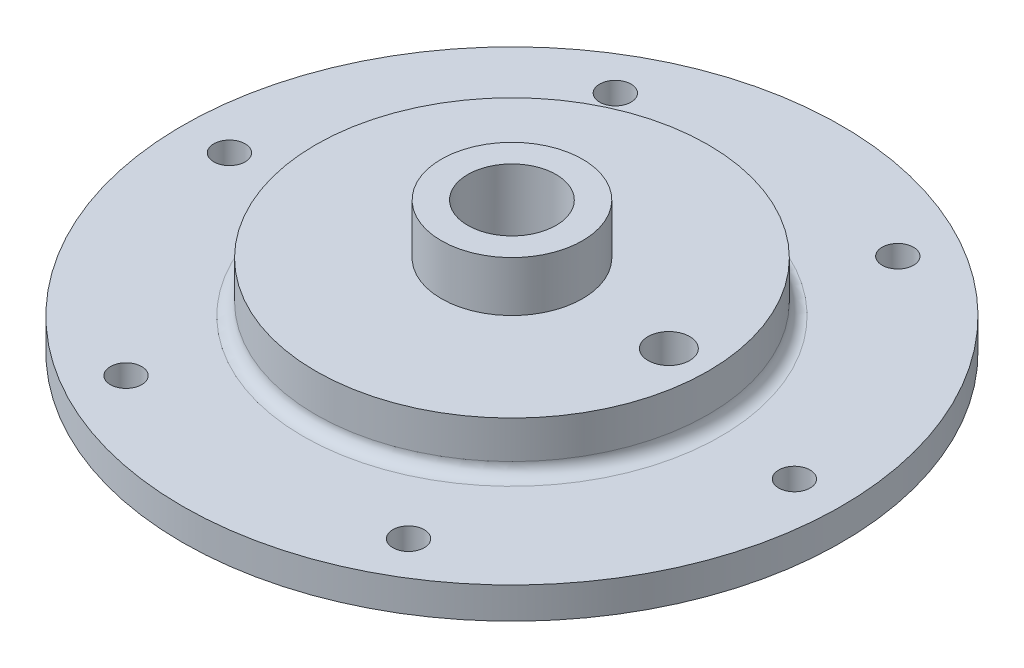
ISO-10303-21;
HEADER;
FILE_DESCRIPTION(('STEP AP214'),'2;1');
FILE_NAME('part.step','',(''),(''),'','','');
FILE_SCHEMA(('AUTOMOTIVE_DESIGN { 1 0 10303 214 1 1 1 1 }'));
ENDSEC;
DATA;
#1=APPLICATION_CONTEXT('core data for automotive mechanical design processes');
#2=APPLICATION_PROTOCOL_DEFINITION('international standard','automotive_design',2000,#1);
#3=PRODUCT_CONTEXT('',#1,'mechanical');
#4=PRODUCT('Part','Part','',(#3));
#5=PRODUCT_RELATED_PRODUCT_CATEGORY('part','',(#4));
#6=PRODUCT_DEFINITION_FORMATION('','',#4);
#7=PRODUCT_DEFINITION_CONTEXT('part definition',#1,'design');
#8=PRODUCT_DEFINITION('design','',#6,#7);
#9=PRODUCT_DEFINITION_SHAPE('','',#8);
#10=(LENGTH_UNIT() NAMED_UNIT(*) SI_UNIT(.MILLI.,.METRE.));
#11=(NAMED_UNIT(*) PLANE_ANGLE_UNIT() SI_UNIT($,.RADIAN.));
#12=(NAMED_UNIT(*) SI_UNIT($,.STERADIAN.) SOLID_ANGLE_UNIT());
#13=UNCERTAINTY_MEASURE_WITH_UNIT(LENGTH_MEASURE(1.E-05),#10,'distance_accuracy_value','');
#14=(GEOMETRIC_REPRESENTATION_CONTEXT(3) GLOBAL_UNCERTAINTY_ASSIGNED_CONTEXT((#13)) GLOBAL_UNIT_ASSIGNED_CONTEXT((#10,
#11,#12)) REPRESENTATION_CONTEXT('',''));
#15=CARTESIAN_POINT('',(0.,0.,0.));
#16=DIRECTION('',(0.,0.,1.));
#17=DIRECTION('',(1.,0.,0.));
#18=AXIS2_PLACEMENT_3D('',#15,#16,#17);
#19=CARTESIAN_POINT('',(0.,6.35,0.));
#20=DIRECTION('',(0.,-1.,0.));
#21=DIRECTION('',(0.,0.,-1.));
#22=AXIS2_PLACEMENT_3D('',#19,#20,#21);
#23=CYLINDRICAL_SURFACE('',#22,66.675);
#24=CARTESIAN_POINT('',(0.,6.35,0.));
#25=DIRECTION('',(0.,1.,0.));
#26=DIRECTION('',(0.,0.,1.));
#27=AXIS2_PLACEMENT_3D('',#24,#25,#26);
#28=CIRCLE('',#27,66.675);
#29=CARTESIAN_POINT('',(0.,6.35,66.675));
#30=VERTEX_POINT('',#29);
#31=EDGE_CURVE('E48',#30,#30,#28,.T.);
#32=ORIENTED_EDGE('',*,*,#31,.F.);
#33=EDGE_LOOP('',(#32));
#34=FACE_BOUND('',#33,.T.);
#35=CARTESIAN_POINT('',(0.,0.,0.));
#36=DIRECTION('',(0.,1.,0.));
#37=DIRECTION('',(0.,0.,1.));
#38=AXIS2_PLACEMENT_3D('',#35,#36,#37);
#39=CIRCLE('',#38,66.675);
#40=CARTESIAN_POINT('',(0.,0.,66.675));
#41=VERTEX_POINT('',#40);
#42=EDGE_CURVE('E52',#41,#41,#39,.T.);
#43=ORIENTED_EDGE('',*,*,#42,.T.);
#44=EDGE_LOOP('',(#43));
#45=FACE_BOUND('',#44,.T.);
#46=ADVANCED_FACE('F37',(#34,#45),#23,.T.);
#47=CARTESIAN_POINT('',(0.,6.35,0.));
#48=DIRECTION('',(0.,1.,0.));
#49=DIRECTION('',(0.,0.,1.));
#50=AXIS2_PLACEMENT_3D('',#47,#48,#49);
#51=PLANE('',#50);
#52=CARTESIAN_POINT('',(-28.5750000000006,6.35,-49.4933518262803));
#53=DIRECTION('',(0.,1.,0.));
#54=DIRECTION('',(0.,0.,1.));
#55=AXIS2_PLACEMENT_3D('',#52,#53,#54);
#56=CIRCLE('',#55,3.175);
#57=CARTESIAN_POINT('',(-28.5750000000006,6.35,-46.3183518262803));
#58=VERTEX_POINT('',#57);
#59=EDGE_CURVE('E99',#58,#58,#56,.T.);
#60=ORIENTED_EDGE('',*,*,#59,.F.);
#61=EDGE_LOOP('',(#60));
#62=FACE_BOUND('',#61,.T.);
#63=CARTESIAN_POINT('',(28.5749999999995,6.35,-49.4933518262809));
#64=DIRECTION('',(0.,1.,0.));
#65=DIRECTION('',(0.,0.,1.));
#66=AXIS2_PLACEMENT_3D('',#63,#64,#65);
#67=CIRCLE('',#66,3.175);
#68=CARTESIAN_POINT('',(28.5749999999995,6.35,-46.3183518262809));
#69=VERTEX_POINT('',#68);
#70=EDGE_CURVE('E93',#69,#69,#67,.T.);
#71=ORIENTED_EDGE('',*,*,#70,.F.);
#72=EDGE_LOOP('',(#71));
#73=FACE_BOUND('',#72,.T.);
#74=CARTESIAN_POINT('',(57.15,6.35,0.));
#75=DIRECTION('',(0.,1.,0.));
#76=DIRECTION('',(0.,0.,1.));
#77=AXIS2_PLACEMENT_3D('',#74,#75,#76);
#78=CIRCLE('',#77,3.175);
#79=CARTESIAN_POINT('',(57.15,6.35,3.175));
#80=VERTEX_POINT('',#79);
#81=EDGE_CURVE('E87',#80,#80,#78,.T.);
#82=ORIENTED_EDGE('',*,*,#81,.F.);
#83=EDGE_LOOP('',(#82));
#84=FACE_BOUND('',#83,.T.);
#85=CARTESIAN_POINT('',(28.5750000000002,6.35,49.4933518262805));
#86=DIRECTION('',(0.,1.,0.));
#87=DIRECTION('',(0.,0.,1.));
#88=AXIS2_PLACEMENT_3D('',#85,#86,#87);
#89=CIRCLE('',#88,3.175);
#90=CARTESIAN_POINT('',(28.5750000000002,6.35,52.6683518262805));
#91=VERTEX_POINT('',#90);
#92=EDGE_CURVE('E81',#91,#91,#89,.T.);
#93=ORIENTED_EDGE('',*,*,#92,.F.);
#94=EDGE_LOOP('',(#93));
#95=FACE_BOUND('',#94,.T.);
#96=CARTESIAN_POINT('',(-28.5749999999999,6.35,49.4933518262807));
#97=DIRECTION('',(0.,1.,0.));
#98=DIRECTION('',(0.,0.,1.));
#99=AXIS2_PLACEMENT_3D('',#96,#97,#98);
#100=CIRCLE('',#99,3.175);
#101=CARTESIAN_POINT('',(-28.5749999999999,6.35,52.6683518262807));
#102=VERTEX_POINT('',#101);
#103=EDGE_CURVE('E75',#102,#102,#100,.T.);
#104=ORIENTED_EDGE('',*,*,#103,.F.);
#105=EDGE_LOOP('',(#104));
#106=FACE_BOUND('',#105,.T.);
#107=CARTESIAN_POINT('',(-57.15,6.35,0.));
#108=DIRECTION('',(0.,1.,0.));
#109=DIRECTION('',(0.,0.,1.));
#110=AXIS2_PLACEMENT_3D('',#107,#108,#109);
#111=CIRCLE('',#110,3.175);
#112=CARTESIAN_POINT('',(-57.15,6.35,3.175));
#113=VERTEX_POINT('',#112);
#114=EDGE_CURVE('E69',#113,#113,#111,.T.);
#115=ORIENTED_EDGE('',*,*,#114,.F.);
#116=EDGE_LOOP('',(#115));
#117=FACE_BOUND('',#116,.T.);
#118=CARTESIAN_POINT('',(0.,6.35,0.));
#119=DIRECTION('',(0.,1.,0.));
#120=DIRECTION('',(0.,0.,1.));
#121=AXIS2_PLACEMENT_3D('',#118,#119,#120);
#122=CIRCLE('',#121,42.2275);
#123=CARTESIAN_POINT('',(0.,6.35,42.2275));
#124=VERTEX_POINT('',#123);
#125=EDGE_CURVE('E10',#124,#124,#122,.F.);
#126=ORIENTED_EDGE('',*,*,#125,.T.);
#127=EDGE_LOOP('',(#126));
#128=FACE_BOUND('',#127,.T.);
#129=ORIENTED_EDGE('',*,*,#31,.T.);
#130=EDGE_LOOP('',(#129));
#131=FACE_BOUND('',#130,.T.);
#132=ADVANCED_FACE('F170',(#62,#73,#84,#95,#106,#117,#128,#131),#51,.T.);
#133=CARTESIAN_POINT('',(0.,0.,0.));
#134=DIRECTION('',(0.,1.,0.));
#135=DIRECTION('',(0.,0.,1.));
#136=AXIS2_PLACEMENT_3D('',#133,#134,#135);
#137=PLANE('',#136);
#138=CARTESIAN_POINT('',(0.,0.,0.));
#139=DIRECTION('',(0.,-1.,0.));
#140=DIRECTION('',(0.,0.,-1.));
#141=AXIS2_PLACEMENT_3D('',#138,#139,#140);
#142=CIRCLE('',#141,42.9514);
#143=CARTESIAN_POINT('',(0.,0.,-42.9514));
#144=VERTEX_POINT('',#143);
#145=EDGE_CURVE('E108',#144,#144,#142,.T.);
#146=ORIENTED_EDGE('',*,*,#145,.F.);
#147=EDGE_LOOP('',(#146));
#148=FACE_BOUND('',#147,.T.);
#149=CARTESIAN_POINT('',(-28.5750000000006,0.,-49.4933518262803));
#150=DIRECTION('',(0.,1.,0.));
#151=DIRECTION('',(0.,0.,1.));
#152=AXIS2_PLACEMENT_3D('',#149,#150,#151);
#153=CIRCLE('',#152,3.175);
#154=CARTESIAN_POINT('',(-28.5750000000006,0.,-46.3183518262803));
#155=VERTEX_POINT('',#154);
#156=EDGE_CURVE('E96',#155,#155,#153,.T.);
#157=ORIENTED_EDGE('',*,*,#156,.T.);
#158=EDGE_LOOP('',(#157));
#159=FACE_BOUND('',#158,.T.);
#160=CARTESIAN_POINT('',(28.5749999999995,0.,-49.4933518262809));
#161=DIRECTION('',(0.,1.,0.));
#162=DIRECTION('',(0.,0.,1.));
#163=AXIS2_PLACEMENT_3D('',#160,#161,#162);
#164=CIRCLE('',#163,3.175);
#165=CARTESIAN_POINT('',(28.5749999999995,0.,-46.3183518262809));
#166=VERTEX_POINT('',#165);
#167=EDGE_CURVE('E90',#166,#166,#164,.T.);
#168=ORIENTED_EDGE('',*,*,#167,.T.);
#169=EDGE_LOOP('',(#168));
#170=FACE_BOUND('',#169,.T.);
#171=CARTESIAN_POINT('',(57.15,0.,0.));
#172=DIRECTION('',(0.,1.,0.));
#173=DIRECTION('',(0.,0.,1.));
#174=AXIS2_PLACEMENT_3D('',#171,#172,#173);
#175=CIRCLE('',#174,3.175);
#176=CARTESIAN_POINT('',(57.15,0.,3.175));
#177=VERTEX_POINT('',#176);
#178=EDGE_CURVE('E84',#177,#177,#175,.T.);
#179=ORIENTED_EDGE('',*,*,#178,.T.);
#180=EDGE_LOOP('',(#179));
#181=FACE_BOUND('',#180,.T.);
#182=CARTESIAN_POINT('',(28.5750000000002,0.,49.4933518262805));
#183=DIRECTION('',(0.,1.,0.));
#184=DIRECTION('',(0.,0.,1.));
#185=AXIS2_PLACEMENT_3D('',#182,#183,#184);
#186=CIRCLE('',#185,3.175);
#187=CARTESIAN_POINT('',(28.5750000000002,0.,52.6683518262805));
#188=VERTEX_POINT('',#187);
#189=EDGE_CURVE('E78',#188,#188,#186,.T.);
#190=ORIENTED_EDGE('',*,*,#189,.T.);
#191=EDGE_LOOP('',(#190));
#192=FACE_BOUND('',#191,.T.);
#193=CARTESIAN_POINT('',(-28.5749999999999,0.,49.4933518262807));
#194=DIRECTION('',(0.,1.,0.));
#195=DIRECTION('',(0.,0.,1.));
#196=AXIS2_PLACEMENT_3D('',#193,#194,#195);
#197=CIRCLE('',#196,3.175);
#198=CARTESIAN_POINT('',(-28.5749999999999,0.,52.6683518262807));
#199=VERTEX_POINT('',#198);
#200=EDGE_CURVE('E72',#199,#199,#197,.T.);
#201=ORIENTED_EDGE('',*,*,#200,.T.);
#202=EDGE_LOOP('',(#201));
#203=FACE_BOUND('',#202,.T.);
#204=CARTESIAN_POINT('',(-57.15,0.,0.));
#205=DIRECTION('',(0.,1.,0.));
#206=DIRECTION('',(0.,0.,1.));
#207=AXIS2_PLACEMENT_3D('',#204,#205,#206);
#208=CIRCLE('',#207,3.175);
#209=CARTESIAN_POINT('',(-57.15,0.,3.175));
#210=VERTEX_POINT('',#209);
#211=EDGE_CURVE('E64',#210,#210,#208,.T.);
#212=ORIENTED_EDGE('',*,*,#211,.T.);
#213=EDGE_LOOP('',(#212));
#214=FACE_BOUND('',#213,.T.);
#215=ORIENTED_EDGE('',*,*,#42,.F.);
#216=EDGE_LOOP('',(#215));
#217=FACE_BOUND('',#216,.T.);
#218=ADVANCED_FACE('F165',(#148,#159,#170,#181,#192,#203,#214,#217),#137,.F.);
#219=CARTESIAN_POINT('',(0.,16.51,0.));
#220=DIRECTION('',(0.,-1.,0.));
#221=DIRECTION('',(0.,0.,-1.));
#222=AXIS2_PLACEMENT_3D('',#219,#220,#221);
#223=CYLINDRICAL_SURFACE('',#222,39.6875);
#224=CARTESIAN_POINT('',(0.,8.89,0.));
#225=DIRECTION('',(0.,1.,0.));
#226=DIRECTION('',(0.,0.,1.));
#227=AXIS2_PLACEMENT_3D('',#224,#225,#226);
#228=CIRCLE('',#227,39.6875);
#229=CARTESIAN_POINT('',(0.,8.89,39.6875));
#230=VERTEX_POINT('',#229);
#231=EDGE_CURVE('E44',#230,#230,#228,.T.);
#232=ORIENTED_EDGE('',*,*,#231,.T.);
#233=EDGE_LOOP('',(#232));
#234=FACE_BOUND('',#233,.T.);
#235=CARTESIAN_POINT('',(0.,16.51,0.));
#236=DIRECTION('',(0.,1.,0.));
#237=DIRECTION('',(0.,0.,1.));
#238=AXIS2_PLACEMENT_3D('',#235,#236,#237);
#239=CIRCLE('',#238,39.6875);
#240=CARTESIAN_POINT('',(0.,16.51,39.6875));
#241=VERTEX_POINT('',#240);
#242=EDGE_CURVE('E56',#241,#241,#239,.T.);
#243=ORIENTED_EDGE('',*,*,#242,.F.);
#244=EDGE_LOOP('',(#243));
#245=FACE_BOUND('',#244,.T.);
#246=ADVANCED_FACE('F158',(#234,#245),#223,.T.);
#247=CARTESIAN_POINT('',(0.,16.51,0.));
#248=DIRECTION('',(0.,1.,0.));
#249=DIRECTION('',(0.,0.,1.));
#250=AXIS2_PLACEMENT_3D('',#247,#248,#249);
#251=PLANE('',#250);
#252=CARTESIAN_POINT('',(0.,16.51,0.));
#253=DIRECTION('',(0.,1.,0.));
#254=DIRECTION('',(0.,0.,1.));
#255=AXIS2_PLACEMENT_3D('',#252,#253,#254);
#256=CIRCLE('',#255,14.2875);
#257=CARTESIAN_POINT('',(0.,16.51,14.2875));
#258=VERTEX_POINT('',#257);
#259=EDGE_CURVE('E127',#258,#258,#256,.T.);
#260=ORIENTED_EDGE('',*,*,#259,.F.);
#261=EDGE_LOOP('',(#260));
#262=FACE_BOUND('',#261,.T.);
#263=CARTESIAN_POINT('',(31.75,16.51,0.));
#264=DIRECTION('',(0.,1.,0.));
#265=DIRECTION('',(0.,0.,1.));
#266=AXIS2_PLACEMENT_3D('',#263,#264,#265);
#267=CIRCLE('',#266,4.21639999999999);
#268=CARTESIAN_POINT('',(31.75,16.51,4.21639999999999));
#269=VERTEX_POINT('',#268);
#270=EDGE_CURVE('E117',#269,#269,#267,.T.);
#271=ORIENTED_EDGE('',*,*,#270,.F.);
#272=EDGE_LOOP('',(#271));
#273=FACE_BOUND('',#272,.T.);
#274=ORIENTED_EDGE('',*,*,#242,.T.);
#275=EDGE_LOOP('',(#274));
#276=FACE_BOUND('',#275,.T.);
#277=ADVANCED_FACE('F155',(#262,#273,#276),#251,.T.);
#278=CARTESIAN_POINT('',(0.,8.89,0.));
#279=DIRECTION('',(0.,1.,0.));
#280=DIRECTION('',(0.,0.,1.));
#281=AXIS2_PLACEMENT_3D('',#278,#279,#280);
#282=TOROIDAL_SURFACE('',#281,42.2275,2.54);
#283=ORIENTED_EDGE('',*,*,#125,.F.);
#284=EDGE_LOOP('',(#283));
#285=FACE_BOUND('',#284,.T.);
#286=ORIENTED_EDGE('',*,*,#231,.F.);
#287=EDGE_LOOP('',(#286));
#288=FACE_BOUND('',#287,.T.);
#289=ADVANCED_FACE('F39',(#285,#288),#282,.F.);
#290=CARTESIAN_POINT('',(-57.15,6.35,0.));
#291=DIRECTION('',(0.,1.,0.));
#292=DIRECTION('',(0.,0.,1.));
#293=AXIS2_PLACEMENT_3D('',#290,#291,#292);
#294=CYLINDRICAL_SURFACE('',#293,3.175);
#295=ORIENTED_EDGE('',*,*,#211,.F.);
#296=EDGE_LOOP('',(#295));
#297=FACE_BOUND('',#296,.T.);
#298=ORIENTED_EDGE('',*,*,#114,.T.);
#299=EDGE_LOOP('',(#298));
#300=FACE_BOUND('',#299,.T.);
#301=ADVANCED_FACE('F200',(#297,#300),#294,.F.);
#302=CARTESIAN_POINT('',(-28.5749999999999,6.35,49.4933518262807));
#303=DIRECTION('',(0.,1.,0.));
#304=DIRECTION('',(0.,0.,1.));
#305=AXIS2_PLACEMENT_3D('',#302,#303,#304);
#306=CYLINDRICAL_SURFACE('',#305,3.175);
#307=ORIENTED_EDGE('',*,*,#200,.F.);
#308=EDGE_LOOP('',(#307));
#309=FACE_BOUND('',#308,.T.);
#310=ORIENTED_EDGE('',*,*,#103,.T.);
#311=EDGE_LOOP('',(#310));
#312=FACE_BOUND('',#311,.T.);
#313=ADVANCED_FACE('F202',(#309,#312),#306,.F.);
#314=CARTESIAN_POINT('',(28.5750000000002,6.35,49.4933518262805));
#315=DIRECTION('',(0.,1.,0.));
#316=DIRECTION('',(0.,0.,1.));
#317=AXIS2_PLACEMENT_3D('',#314,#315,#316);
#318=CYLINDRICAL_SURFACE('',#317,3.175);
#319=ORIENTED_EDGE('',*,*,#189,.F.);
#320=EDGE_LOOP('',(#319));
#321=FACE_BOUND('',#320,.T.);
#322=ORIENTED_EDGE('',*,*,#92,.T.);
#323=EDGE_LOOP('',(#322));
#324=FACE_BOUND('',#323,.T.);
#325=ADVANCED_FACE('F209',(#321,#324),#318,.F.);
#326=CARTESIAN_POINT('',(57.15,6.35,0.));
#327=DIRECTION('',(0.,1.,0.));
#328=DIRECTION('',(0.,0.,1.));
#329=AXIS2_PLACEMENT_3D('',#326,#327,#328);
#330=CYLINDRICAL_SURFACE('',#329,3.175);
#331=ORIENTED_EDGE('',*,*,#178,.F.);
#332=EDGE_LOOP('',(#331));
#333=FACE_BOUND('',#332,.T.);
#334=ORIENTED_EDGE('',*,*,#81,.T.);
#335=EDGE_LOOP('',(#334));
#336=FACE_BOUND('',#335,.T.);
#337=ADVANCED_FACE('F276',(#333,#336),#330,.F.);
#338=CARTESIAN_POINT('',(28.5749999999995,6.35,-49.4933518262809));
#339=DIRECTION('',(0.,1.,0.));
#340=DIRECTION('',(0.,0.,1.));
#341=AXIS2_PLACEMENT_3D('',#338,#339,#340);
#342=CYLINDRICAL_SURFACE('',#341,3.175);
#343=ORIENTED_EDGE('',*,*,#167,.F.);
#344=EDGE_LOOP('',(#343));
#345=FACE_BOUND('',#344,.T.);
#346=ORIENTED_EDGE('',*,*,#70,.T.);
#347=EDGE_LOOP('',(#346));
#348=FACE_BOUND('',#347,.T.);
#349=ADVANCED_FACE('F280',(#345,#348),#342,.F.);
#350=CARTESIAN_POINT('',(-28.5750000000006,6.35,-49.4933518262803));
#351=DIRECTION('',(0.,1.,0.));
#352=DIRECTION('',(0.,0.,1.));
#353=AXIS2_PLACEMENT_3D('',#350,#351,#352);
#354=CYLINDRICAL_SURFACE('',#353,3.175);
#355=ORIENTED_EDGE('',*,*,#156,.F.);
#356=EDGE_LOOP('',(#355));
#357=FACE_BOUND('',#356,.T.);
#358=ORIENTED_EDGE('',*,*,#59,.T.);
#359=EDGE_LOOP('',(#358));
#360=FACE_BOUND('',#359,.T.);
#361=ADVANCED_FACE('F248',(#357,#360),#354,.F.);
#362=CARTESIAN_POINT('',(0.,-1.27,0.));
#363=DIRECTION('',(0.,-1.,0.));
#364=DIRECTION('',(0.,0.,-1.));
#365=AXIS2_PLACEMENT_3D('',#362,#363,#364);
#366=CYLINDRICAL_SURFACE('',#365,37.6174);
#367=CARTESIAN_POINT('',(0.,0.,0.));
#368=DIRECTION('',(0.,-1.,0.));
#369=DIRECTION('',(0.,0.,-1.));
#370=AXIS2_PLACEMENT_3D('',#367,#368,#369);
#371=CIRCLE('',#370,37.6174);
#372=CARTESIAN_POINT('',(0.,0.,-37.6174));
#373=VERTEX_POINT('',#372);
#374=EDGE_CURVE('E111',#373,#373,#371,.T.);
#375=ORIENTED_EDGE('',*,*,#374,.F.);
#376=EDGE_LOOP('',(#375));
#377=FACE_BOUND('',#376,.T.);
#378=CARTESIAN_POINT('',(0.,2.7178,0.));
#379=DIRECTION('',(0.,-1.,0.));
#380=DIRECTION('',(0.,0.,-1.));
#381=AXIS2_PLACEMENT_3D('',#378,#379,#380);
#382=CIRCLE('',#381,37.6174);
#383=CARTESIAN_POINT('',(0.,2.7178,-37.6174));
#384=VERTEX_POINT('',#383);
#385=EDGE_CURVE('E102',#384,#384,#382,.T.);
#386=ORIENTED_EDGE('',*,*,#385,.T.);
#387=EDGE_LOOP('',(#386));
#388=FACE_BOUND('',#387,.T.);
#389=ADVANCED_FACE('F244',(#377,#388),#366,.T.);
#390=CARTESIAN_POINT('',(37.6174,2.7178,0.));
#391=DIRECTION('',(0.,1.,0.));
#392=DIRECTION('',(0.,0.,1.));
#393=AXIS2_PLACEMENT_3D('',#390,#391,#392);
#394=PLANE('',#393);
#395=ORIENTED_EDGE('',*,*,#385,.F.);
#396=EDGE_LOOP('',(#395));
#397=FACE_BOUND('',#396,.T.);
#398=CARTESIAN_POINT('',(0.,2.7178,0.));
#399=DIRECTION('',(0.,-1.,0.));
#400=DIRECTION('',(0.,0.,-1.));
#401=AXIS2_PLACEMENT_3D('',#398,#399,#400);
#402=CIRCLE('',#401,42.9514);
#403=CARTESIAN_POINT('',(0.,2.7178,-42.9514));
#404=VERTEX_POINT('',#403);
#405=EDGE_CURVE('E105',#404,#404,#402,.T.);
#406=ORIENTED_EDGE('',*,*,#405,.T.);
#407=EDGE_LOOP('',(#406));
#408=FACE_BOUND('',#407,.T.);
#409=ADVANCED_FACE('F247',(#397,#408),#394,.F.);
#410=CARTESIAN_POINT('',(0.,-1.27,0.));
#411=DIRECTION('',(0.,-1.,0.));
#412=DIRECTION('',(0.,0.,-1.));
#413=AXIS2_PLACEMENT_3D('',#410,#411,#412);
#414=CYLINDRICAL_SURFACE('',#413,42.9514);
#415=ORIENTED_EDGE('',*,*,#405,.F.);
#416=EDGE_LOOP('',(#415));
#417=FACE_BOUND('',#416,.T.);
#418=ORIENTED_EDGE('',*,*,#145,.T.);
#419=EDGE_LOOP('',(#418));
#420=FACE_BOUND('',#419,.T.);
#421=ADVANCED_FACE('F220',(#417,#420),#414,.F.);
#422=CARTESIAN_POINT('',(0.,11.557,0.));
#423=DIRECTION('',(0.,-1.,0.));
#424=DIRECTION('',(0.,0.,-1.));
#425=AXIS2_PLACEMENT_3D('',#422,#423,#424);
#426=PLANE('',#425);
#427=CARTESIAN_POINT('',(0.,11.557,0.));
#428=DIRECTION('',(0.,-1.,0.));
#429=DIRECTION('',(0.,0.,-1.));
#430=AXIS2_PLACEMENT_3D('',#427,#428,#429);
#431=CIRCLE('',#430,8.929751);
#432=CARTESIAN_POINT('',(0.,11.557,-8.929751));
#433=VERTEX_POINT('',#432);
#434=EDGE_CURVE('E130',#433,#433,#431,.T.);
#435=ORIENTED_EDGE('',*,*,#434,.F.);
#436=EDGE_LOOP('',(#435));
#437=FACE_BOUND('',#436,.T.);
#438=CARTESIAN_POINT('',(0.,11.557,0.));
#439=DIRECTION('',(0.,-1.,0.));
#440=DIRECTION('',(0.,0.,-1.));
#441=AXIS2_PLACEMENT_3D('',#438,#439,#440);
#442=CIRCLE('',#441,23.749);
#443=CARTESIAN_POINT('',(0.,11.557,-23.749));
#444=VERTEX_POINT('',#443);
#445=EDGE_CURVE('E60',#444,#444,#442,.T.);
#446=ORIENTED_EDGE('',*,*,#445,.T.);
#447=EDGE_LOOP('',(#446));
#448=FACE_BOUND('',#447,.T.);
#449=ADVANCED_FACE('F216',(#437,#448),#426,.T.);
#450=CARTESIAN_POINT('',(0.,11.557,0.));
#451=DIRECTION('',(0.,-1.,0.));
#452=DIRECTION('',(0.,0.,-1.));
#453=AXIS2_PLACEMENT_3D('',#450,#451,#452);
#454=CYLINDRICAL_SURFACE('',#453,23.749);
#455=ORIENTED_EDGE('',*,*,#445,.F.);
#456=EDGE_LOOP('',(#455));
#457=FACE_BOUND('',#456,.T.);
#458=CARTESIAN_POINT('',(0.,0.,0.));
#459=DIRECTION('',(0.,-1.,0.));
#460=DIRECTION('',(0.,0.,-1.));
#461=AXIS2_PLACEMENT_3D('',#458,#459,#460);
#462=CIRCLE('',#461,23.749);
#463=CARTESIAN_POINT('',(0.,0.,-23.749));
#464=VERTEX_POINT('',#463);
#465=EDGE_CURVE('E61',#464,#464,#462,.T.);
#466=ORIENTED_EDGE('',*,*,#465,.T.);
#467=EDGE_LOOP('',(#466));
#468=FACE_BOUND('',#467,.T.);
#469=ADVANCED_FACE('F219',(#457,#468),#454,.F.);
#470=CARTESIAN_POINT('',(31.75,0.,0.));
#471=DIRECTION('',(0.,-1.,0.));
#472=DIRECTION('',(0.,0.,-1.));
#473=AXIS2_PLACEMENT_3D('',#470,#471,#472);
#474=CIRCLE('',#473,1.19062499999999);
#475=CARTESIAN_POINT('',(31.75,0.,-1.19062499999999));
#476=VERTEX_POINT('',#475);
#477=EDGE_CURVE('E123',#476,#476,#474,.T.);
#478=ORIENTED_EDGE('',*,*,#477,.F.);
#479=EDGE_LOOP('',(#478));
#480=FACE_BOUND('',#479,.T.);
#481=ORIENTED_EDGE('',*,*,#374,.T.);
#482=EDGE_LOOP('',(#481));
#483=FACE_BOUND('',#482,.T.);
#484=ORIENTED_EDGE('',*,*,#465,.F.);
#485=EDGE_LOOP('',(#484));
#486=FACE_BOUND('',#485,.T.);
#487=ADVANCED_FACE('F173',(#480,#483,#486),#137,.F.);
#488=CARTESIAN_POINT('',(31.75,7.62,0.));
#489=DIRECTION('',(0.,1.,0.));
#490=DIRECTION('',(0.,0.,1.));
#491=AXIS2_PLACEMENT_3D('',#488,#489,#490);
#492=CONICAL_SURFACE('',#491,4.21639999999999,1.02974425867665);
#493=CARTESIAN_POINT('',(31.75,5.80193096046188,0.));
#494=DIRECTION('',(0.,1.,0.));
#495=DIRECTION('',(0.,0.,1.));
#496=AXIS2_PLACEMENT_3D('',#493,#494,#495);
#497=CIRCLE('',#496,1.19062499999999);
#498=CARTESIAN_POINT('',(31.75,5.80193096046188,1.19062499999999));
#499=VERTEX_POINT('',#498);
#500=EDGE_CURVE('E120',#499,#499,#497,.F.);
#501=ORIENTED_EDGE('',*,*,#500,.T.);
#502=EDGE_LOOP('',(#501));
#503=FACE_BOUND('',#502,.T.);
#504=CARTESIAN_POINT('',(31.75,7.62,0.));
#505=DIRECTION('',(0.,1.,0.));
#506=DIRECTION('',(0.,0.,1.));
#507=AXIS2_PLACEMENT_3D('',#504,#505,#506);
#508=CIRCLE('',#507,4.21639999999999);
#509=CARTESIAN_POINT('',(31.75,7.62,4.21639999999999));
#510=VERTEX_POINT('',#509);
#511=EDGE_CURVE('E114',#510,#510,#508,.T.);
#512=ORIENTED_EDGE('',*,*,#511,.T.);
#513=EDGE_LOOP('',(#512));
#514=FACE_BOUND('',#513,.T.);
#515=ADVANCED_FACE('F227',(#503,#514),#492,.F.);
#516=CARTESIAN_POINT('',(31.75,16.51,0.));
#517=DIRECTION('',(0.,1.,0.));
#518=DIRECTION('',(0.,0.,1.));
#519=AXIS2_PLACEMENT_3D('',#516,#517,#518);
#520=CYLINDRICAL_SURFACE('',#519,4.21639999999999);
#521=ORIENTED_EDGE('',*,*,#511,.F.);
#522=EDGE_LOOP('',(#521));
#523=FACE_BOUND('',#522,.T.);
#524=ORIENTED_EDGE('',*,*,#270,.T.);
#525=EDGE_LOOP('',(#524));
#526=FACE_BOUND('',#525,.T.);
#527=ADVANCED_FACE('F237',(#523,#526),#520,.F.);
#528=CARTESIAN_POINT('',(31.75,0.,0.));
#529=DIRECTION('',(0.,-1.,0.));
#530=DIRECTION('',(0.,0.,-1.));
#531=AXIS2_PLACEMENT_3D('',#528,#529,#530);
#532=CYLINDRICAL_SURFACE('',#531,1.19062499999999);
#533=ORIENTED_EDGE('',*,*,#477,.T.);
#534=EDGE_LOOP('',(#533));
#535=FACE_BOUND('',#534,.T.);
#536=ORIENTED_EDGE('',*,*,#500,.F.);
#537=EDGE_LOOP('',(#536));
#538=FACE_BOUND('',#537,.T.);
#539=ADVANCED_FACE('F151',(#535,#538),#532,.F.);
#540=CARTESIAN_POINT('',(0.,26.67,0.));
#541=DIRECTION('',(0.,-1.,0.));
#542=DIRECTION('',(0.,0.,-1.));
#543=AXIS2_PLACEMENT_3D('',#540,#541,#542);
#544=CYLINDRICAL_SURFACE('',#543,14.2875);
#545=CARTESIAN_POINT('',(0.,26.67,0.));
#546=DIRECTION('',(0.,1.,0.));
#547=DIRECTION('',(0.,0.,1.));
#548=AXIS2_PLACEMENT_3D('',#545,#546,#547);
#549=CIRCLE('',#548,14.2875);
#550=CARTESIAN_POINT('',(0.,26.67,14.2875));
#551=VERTEX_POINT('',#550);
#552=EDGE_CURVE('E126',#551,#551,#549,.T.);
#553=ORIENTED_EDGE('',*,*,#552,.F.);
#554=EDGE_LOOP('',(#553));
#555=FACE_BOUND('',#554,.T.);
#556=ORIENTED_EDGE('',*,*,#259,.T.);
#557=EDGE_LOOP('',(#556));
#558=FACE_BOUND('',#557,.T.);
#559=ADVANCED_FACE('F145',(#555,#558),#544,.T.);
#560=CARTESIAN_POINT('',(0.,26.67,0.));
#561=DIRECTION('',(0.,1.,0.));
#562=DIRECTION('',(0.,0.,1.));
#563=AXIS2_PLACEMENT_3D('',#560,#561,#562);
#564=PLANE('',#563);
#565=CARTESIAN_POINT('',(0.,26.67,0.));
#566=DIRECTION('',(0.,1.,0.));
#567=DIRECTION('',(0.,0.,1.));
#568=AXIS2_PLACEMENT_3D('',#565,#566,#567);
#569=CIRCLE('',#568,8.929751);
#570=CARTESIAN_POINT('',(0.,26.67,8.929751));
#571=VERTEX_POINT('',#570);
#572=EDGE_CURVE('E135',#571,#571,#569,.T.);
#573=ORIENTED_EDGE('',*,*,#572,.F.);
#574=EDGE_LOOP('',(#573));
#575=FACE_BOUND('',#574,.T.);
#576=ORIENTED_EDGE('',*,*,#552,.T.);
#577=EDGE_LOOP('',(#576));
#578=FACE_BOUND('',#577,.T.);
#579=ADVANCED_FACE('F142',(#575,#578),#564,.T.);
#580=CARTESIAN_POINT('',(0.,26.67,0.));
#581=DIRECTION('',(0.,1.,0.));
#582=DIRECTION('',(0.,0.,1.));
#583=AXIS2_PLACEMENT_3D('',#580,#581,#582);
#584=CYLINDRICAL_SURFACE('',#583,8.929751);
#585=ORIENTED_EDGE('',*,*,#572,.T.);
#586=EDGE_LOOP('',(#585));
#587=FACE_BOUND('',#586,.T.);
#588=ORIENTED_EDGE('',*,*,#434,.T.);
#589=EDGE_LOOP('',(#588));
#590=FACE_BOUND('',#589,.T.);
#591=ADVANCED_FACE('F139',(#587,#590),#584,.F.);
#592=CLOSED_SHELL('',(#46,#132,#218,#246,#277,#289,#301,#313,#325,#337,#349,#361,#389,#409,#421,
#449,#469,#487,#515,#527,#539,#559,#579,#591));
#593=MANIFOLD_SOLID_BREP('B2',#592);
#594=ADVANCED_BREP_SHAPE_REPRESENTATION('',(#18,#593),#14);
#595=SHAPE_DEFINITION_REPRESENTATION(#9,#594);
ENDSEC;
END-ISO-10303-21;
